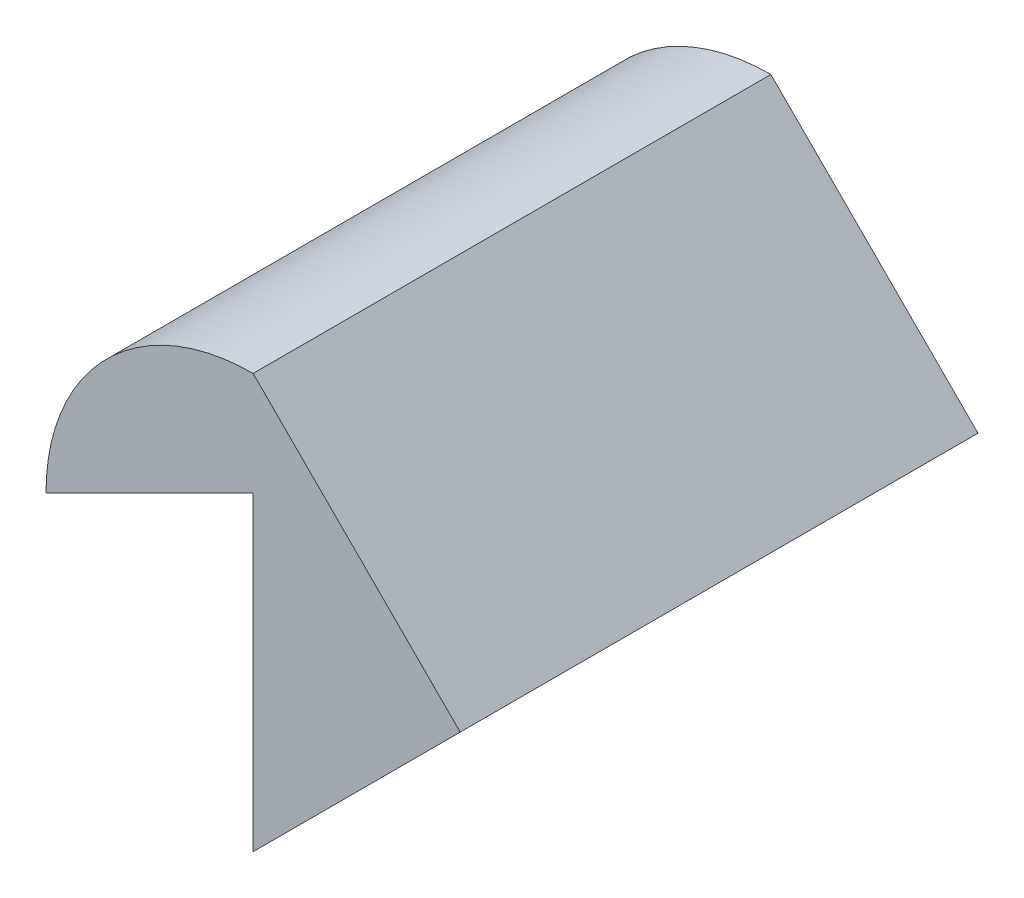
ISO-10303-21;
HEADER;
FILE_DESCRIPTION(('STEP AP214'),'2;1');
FILE_NAME('part.step','',(''),(''),'','','');
FILE_SCHEMA(('AUTOMOTIVE_DESIGN { 1 0 10303 214 1 1 1 1 }'));
ENDSEC;
DATA;
#1=APPLICATION_CONTEXT('core data for automotive mechanical design processes');
#2=APPLICATION_PROTOCOL_DEFINITION('international standard','automotive_design',2000,#1);
#3=PRODUCT_CONTEXT('',#1,'mechanical');
#4=PRODUCT('Part','Part','',(#3));
#5=PRODUCT_RELATED_PRODUCT_CATEGORY('part','',(#4));
#6=PRODUCT_DEFINITION_FORMATION('','',#4);
#7=PRODUCT_DEFINITION_CONTEXT('part definition',#1,'design');
#8=PRODUCT_DEFINITION('design','',#6,#7);
#9=PRODUCT_DEFINITION_SHAPE('','',#8);
#10=(LENGTH_UNIT() NAMED_UNIT(*) SI_UNIT(.MILLI.,.METRE.));
#11=(NAMED_UNIT(*) PLANE_ANGLE_UNIT() SI_UNIT($,.RADIAN.));
#12=(NAMED_UNIT(*) SI_UNIT($,.STERADIAN.) SOLID_ANGLE_UNIT());
#13=UNCERTAINTY_MEASURE_WITH_UNIT(LENGTH_MEASURE(1.E-05),#10,'distance_accuracy_value','');
#14=(GEOMETRIC_REPRESENTATION_CONTEXT(3) GLOBAL_UNCERTAINTY_ASSIGNED_CONTEXT((#13)) GLOBAL_UNIT_ASSIGNED_CONTEXT((#10,
#11,#12)) REPRESENTATION_CONTEXT('',''));
#15=CARTESIAN_POINT('',(0.,0.,0.));
#16=DIRECTION('',(0.,0.,1.));
#17=DIRECTION('',(1.,0.,0.));
#18=AXIS2_PLACEMENT_3D('',#15,#16,#17);
#19=CARTESIAN_POINT('',(-10.,5.,25.));
#20=DIRECTION('',(-0.447213595499958,0.894427190999916,0.));
#21=DIRECTION('',(-0.894427190999916,-0.447213595499958,0.));
#22=AXIS2_PLACEMENT_3D('',#19,#20,#21);
#23=PLANE('',#22);
#24=DIRECTION('',(0.894427190999916,0.447213595499958,0.));
#25=VECTOR('',#24,1.);
#26=CARTESIAN_POINT('',(-10.,5.,0.));
#27=LINE('',#26,#25);
#28=CARTESIAN_POINT('',(-20.,0.,0.));
#29=VERTEX_POINT('',#28);
#30=CARTESIAN_POINT('',(-10.,5.,0.));
#31=VERTEX_POINT('',#30);
#32=EDGE_CURVE('E107',#29,#31,#27,.T.);
#33=ORIENTED_EDGE('',*,*,#32,.T.);
#34=DIRECTION('',(0.,0.,-1.));
#35=VECTOR('',#34,1.);
#36=CARTESIAN_POINT('',(-10.,5.,25.));
#37=LINE('',#36,#35);
#38=CARTESIAN_POINT('',(-10.,5.,25.));
#39=VERTEX_POINT('',#38);
#40=EDGE_CURVE('E11',#39,#31,#37,.T.);
#41=ORIENTED_EDGE('',*,*,#40,.F.);
#42=DIRECTION('',(0.894427190999916,0.447213595499958,0.));
#43=VECTOR('',#42,1.);
#44=CARTESIAN_POINT('',(-10.,5.,25.));
#45=LINE('',#44,#43);
#46=CARTESIAN_POINT('',(-20.,0.,25.));
#47=VERTEX_POINT('',#46);
#48=EDGE_CURVE('E115',#47,#39,#45,.T.);
#49=ORIENTED_EDGE('',*,*,#48,.F.);
#50=DIRECTION('',(0.,0.,-1.));
#51=VECTOR('',#50,1.);
#52=CARTESIAN_POINT('',(-20.,0.,25.));
#53=LINE('',#52,#51);
#54=EDGE_CURVE('E103',#47,#29,#53,.T.);
#55=ORIENTED_EDGE('',*,*,#54,.T.);
#56=EDGE_LOOP('',(#33,#41,#49,#55));
#57=FACE_BOUND('',#56,.T.);
#58=ADVANCED_FACE('F33',(#57),#23,.F.);
#59=CARTESIAN_POINT('',(-10.,5.,25.));
#60=DIRECTION('',(1.,0.,0.));
#61=DIRECTION('',(0.,1.,0.));
#62=AXIS2_PLACEMENT_3D('',#59,#60,#61);
#63=PLANE('',#62);
#64=DIRECTION('',(0.,-1.,0.));
#65=VECTOR('',#64,1.);
#66=CARTESIAN_POINT('',(-10.,5.,0.));
#67=LINE('',#66,#65);
#68=CARTESIAN_POINT('',(-10.,-10.,0.));
#69=VERTEX_POINT('',#68);
#70=EDGE_CURVE('E110',#31,#69,#67,.T.);
#71=ORIENTED_EDGE('',*,*,#70,.T.);
#72=DIRECTION('',(0.,0.,-1.));
#73=VECTOR('',#72,1.);
#74=CARTESIAN_POINT('',(-10.,-10.,25.));
#75=LINE('',#74,#73);
#76=CARTESIAN_POINT('',(-10.,-10.,25.));
#77=VERTEX_POINT('',#76);
#78=EDGE_CURVE('E41',#77,#69,#75,.T.);
#79=ORIENTED_EDGE('',*,*,#78,.F.);
#80=DIRECTION('',(0.,-1.,0.));
#81=VECTOR('',#80,1.);
#82=CARTESIAN_POINT('',(-10.,5.,25.));
#83=LINE('',#82,#81);
#84=EDGE_CURVE('E83',#39,#77,#83,.T.);
#85=ORIENTED_EDGE('',*,*,#84,.F.);
#86=ORIENTED_EDGE('',*,*,#40,.T.);
#87=EDGE_LOOP('',(#71,#79,#85,#86));
#88=FACE_BOUND('',#87,.T.);
#89=ADVANCED_FACE('F134',(#88),#63,.F.);
#90=CARTESIAN_POINT('',(-10.,-10.,25.));
#91=DIRECTION('',(-0.707106781186548,0.707106781186547,0.));
#92=DIRECTION('',(-0.707106781186547,-0.707106781186548,0.));
#93=AXIS2_PLACEMENT_3D('',#90,#91,#92);
#94=PLANE('',#93);
#95=DIRECTION('',(0.707106781186547,0.707106781186548,0.));
#96=VECTOR('',#95,1.);
#97=CARTESIAN_POINT('',(-10.,-10.,0.));
#98=LINE('',#97,#96);
#99=CARTESIAN_POINT('',(0.,0.,0.));
#100=VERTEX_POINT('',#99);
#101=EDGE_CURVE('E98',#69,#100,#98,.T.);
#102=ORIENTED_EDGE('',*,*,#101,.T.);
#103=DIRECTION('',(0.,0.,-1.));
#104=VECTOR('',#103,1.);
#105=CARTESIAN_POINT('',(0.,0.,25.));
#106=LINE('',#105,#104);
#107=CARTESIAN_POINT('',(0.,0.,25.));
#108=VERTEX_POINT('',#107);
#109=EDGE_CURVE('E95',#108,#100,#106,.T.);
#110=ORIENTED_EDGE('',*,*,#109,.F.);
#111=DIRECTION('',(0.707106781186547,0.707106781186548,0.));
#112=VECTOR('',#111,1.);
#113=CARTESIAN_POINT('',(-10.,-10.,25.));
#114=LINE('',#113,#112);
#115=EDGE_CURVE('E87',#77,#108,#114,.T.);
#116=ORIENTED_EDGE('',*,*,#115,.F.);
#117=ORIENTED_EDGE('',*,*,#78,.T.);
#118=EDGE_LOOP('',(#102,#110,#116,#117));
#119=FACE_BOUND('',#118,.T.);
#120=ADVANCED_FACE('F96',(#119),#94,.F.);
#121=CARTESIAN_POINT('',(0.,0.,25.));
#122=DIRECTION('',(-0.707106781186547,-0.707106781186548,0.));
#123=DIRECTION('',(0.707106781186548,-0.707106781186547,0.));
#124=AXIS2_PLACEMENT_3D('',#121,#122,#123);
#125=PLANE('',#124);
#126=DIRECTION('',(-0.707106781186548,0.707106781186547,0.));
#127=VECTOR('',#126,1.);
#128=CARTESIAN_POINT('',(0.,0.,0.));
#129=LINE('',#128,#127);
#130=CARTESIAN_POINT('',(-10.,10.,0.));
#131=VERTEX_POINT('',#130);
#132=EDGE_CURVE('E69',#100,#131,#129,.T.);
#133=ORIENTED_EDGE('',*,*,#132,.T.);
#134=DIRECTION('',(0.,0.,-1.));
#135=VECTOR('',#134,1.);
#136=CARTESIAN_POINT('',(-10.,10.,25.));
#137=LINE('',#136,#135);
#138=CARTESIAN_POINT('',(-10.,10.,25.));
#139=VERTEX_POINT('',#138);
#140=EDGE_CURVE('E99',#139,#131,#137,.T.);
#141=ORIENTED_EDGE('',*,*,#140,.F.);
#142=DIRECTION('',(-0.707106781186548,0.707106781186547,0.));
#143=VECTOR('',#142,1.);
#144=CARTESIAN_POINT('',(0.,0.,25.));
#145=LINE('',#144,#143);
#146=EDGE_CURVE('E91',#108,#139,#145,.T.);
#147=ORIENTED_EDGE('',*,*,#146,.F.);
#148=ORIENTED_EDGE('',*,*,#109,.T.);
#149=EDGE_LOOP('',(#133,#141,#147,#148));
#150=FACE_BOUND('',#149,.T.);
#151=ADVANCED_FACE('F101',(#150),#125,.F.);
#152=CARTESIAN_POINT('',(-10.,0.,25.));
#153=DIRECTION('',(0.,0.,-1.));
#154=DIRECTION('',(-1.,0.,0.));
#155=AXIS2_PLACEMENT_3D('',#152,#153,#154);
#156=CYLINDRICAL_SURFACE('',#155,10.);
#157=CARTESIAN_POINT('',(-10.,0.,0.));
#158=DIRECTION('',(0.,0.,1.));
#159=DIRECTION('',(-1.,0.,0.));
#160=AXIS2_PLACEMENT_3D('',#157,#158,#159);
#161=CIRCLE('',#160,10.);
#162=EDGE_CURVE('E75',#131,#29,#161,.T.);
#163=ORIENTED_EDGE('',*,*,#162,.T.);
#164=ORIENTED_EDGE('',*,*,#54,.F.);
#165=CARTESIAN_POINT('',(-10.,0.,25.));
#166=DIRECTION('',(0.,0.,1.));
#167=DIRECTION('',(-1.,0.,0.));
#168=AXIS2_PLACEMENT_3D('',#165,#166,#167);
#169=CIRCLE('',#168,10.);
#170=EDGE_CURVE('E49',#139,#47,#169,.T.);
#171=ORIENTED_EDGE('',*,*,#170,.F.);
#172=ORIENTED_EDGE('',*,*,#140,.T.);
#173=EDGE_LOOP('',(#163,#164,#171,#172));
#174=FACE_BOUND('',#173,.T.);
#175=ADVANCED_FACE('F123',(#174),#156,.T.);
#176=CARTESIAN_POINT('',(-10.,0.,25.));
#177=DIRECTION('',(0.,0.,-1.));
#178=DIRECTION('',(-1.,0.,0.));
#179=AXIS2_PLACEMENT_3D('',#176,#177,#178);
#180=PLANE('',#179);
#181=ORIENTED_EDGE('',*,*,#48,.T.);
#182=ORIENTED_EDGE('',*,*,#84,.T.);
#183=ORIENTED_EDGE('',*,*,#115,.T.);
#184=ORIENTED_EDGE('',*,*,#146,.T.);
#185=ORIENTED_EDGE('',*,*,#170,.T.);
#186=EDGE_LOOP('',(#181,#182,#183,#184,#185));
#187=FACE_BOUND('',#186,.T.);
#188=ADVANCED_FACE('F89',(#187),#180,.F.);
#189=CARTESIAN_POINT('',(-10.,0.,0.));
#190=DIRECTION('',(0.,0.,-1.));
#191=DIRECTION('',(-1.,0.,0.));
#192=AXIS2_PLACEMENT_3D('',#189,#190,#191);
#193=PLANE('',#192);
#194=ORIENTED_EDGE('',*,*,#32,.F.);
#195=ORIENTED_EDGE('',*,*,#162,.F.);
#196=ORIENTED_EDGE('',*,*,#132,.F.);
#197=ORIENTED_EDGE('',*,*,#101,.F.);
#198=ORIENTED_EDGE('',*,*,#70,.F.);
#199=EDGE_LOOP('',(#194,#195,#196,#197,#198));
#200=FACE_BOUND('',#199,.T.);
#201=ADVANCED_FACE('F119',(#200),#193,.T.);
#202=CLOSED_SHELL('',(#58,#89,#120,#151,#175,#188,#201));
#203=MANIFOLD_SOLID_BREP('B2',#202);
#204=ADVANCED_BREP_SHAPE_REPRESENTATION('',(#18,#203),#14);
#205=SHAPE_DEFINITION_REPRESENTATION(#9,#204);
ENDSEC;
END-ISO-10303-21;
